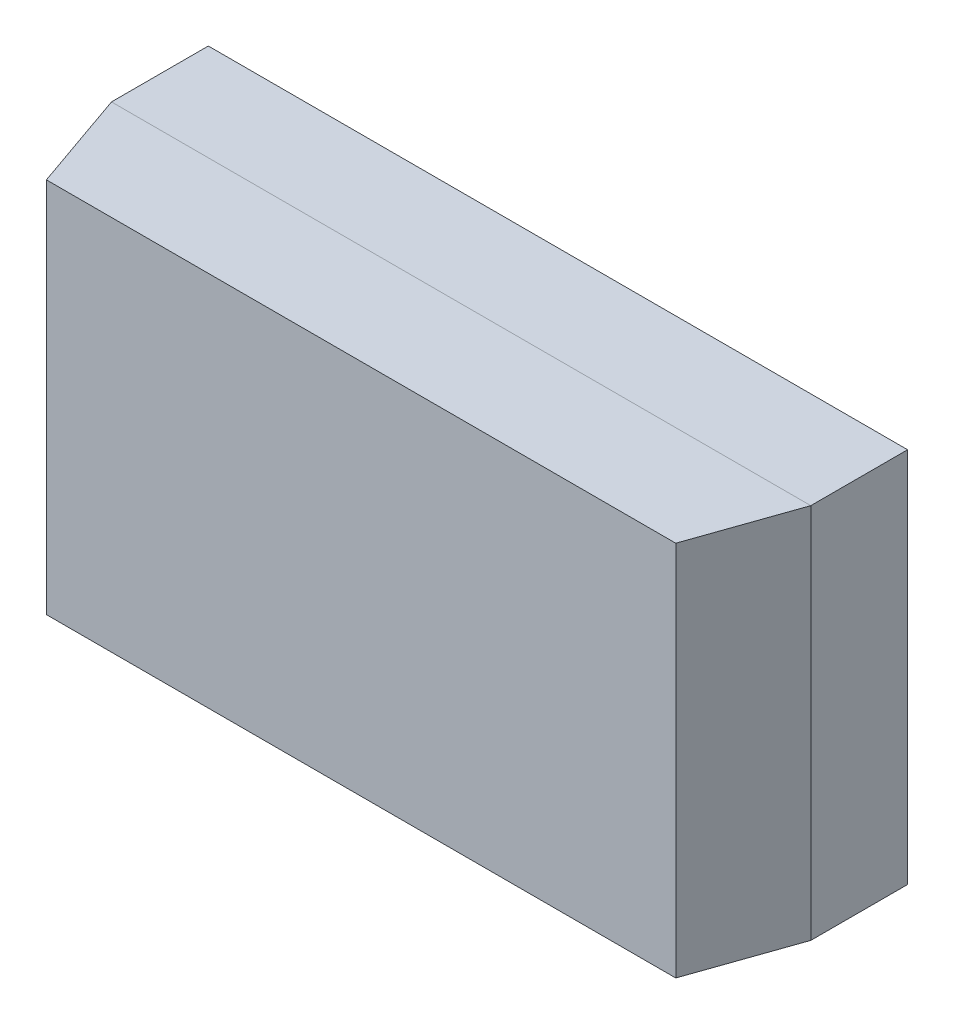
ISO-10303-21;
HEADER;
FILE_DESCRIPTION(('STEP AP214'),'2;1');
FILE_NAME('part.step','',(''),(''),'','','');
FILE_SCHEMA(('AUTOMOTIVE_DESIGN { 1 0 10303 214 1 1 1 1 }'));
ENDSEC;
DATA;
#1=APPLICATION_CONTEXT('core data for automotive mechanical design processes');
#2=APPLICATION_PROTOCOL_DEFINITION('international standard','automotive_design',2000,#1);
#3=PRODUCT_CONTEXT('',#1,'mechanical');
#4=PRODUCT('Part','Part','',(#3));
#5=PRODUCT_RELATED_PRODUCT_CATEGORY('part','',(#4));
#6=PRODUCT_DEFINITION_FORMATION('','',#4);
#7=PRODUCT_DEFINITION_CONTEXT('part definition',#1,'design');
#8=PRODUCT_DEFINITION('design','',#6,#7);
#9=PRODUCT_DEFINITION_SHAPE('','',#8);
#10=(LENGTH_UNIT() NAMED_UNIT(*) SI_UNIT(.MILLI.,.METRE.));
#11=(NAMED_UNIT(*) PLANE_ANGLE_UNIT() SI_UNIT($,.RADIAN.));
#12=(NAMED_UNIT(*) SI_UNIT($,.STERADIAN.) SOLID_ANGLE_UNIT());
#13=UNCERTAINTY_MEASURE_WITH_UNIT(LENGTH_MEASURE(1.E-05),#10,'distance_accuracy_value','');
#14=(GEOMETRIC_REPRESENTATION_CONTEXT(3) GLOBAL_UNCERTAINTY_ASSIGNED_CONTEXT((#13)) GLOBAL_UNIT_ASSIGNED_CONTEXT((#10,
#11,#12)) REPRESENTATION_CONTEXT('',''));
#15=CARTESIAN_POINT('',(0.,0.,0.));
#16=DIRECTION('',(0.,0.,1.));
#17=DIRECTION('',(1.,0.,0.));
#18=AXIS2_PLACEMENT_3D('',#15,#16,#17);
#19=CARTESIAN_POINT('',(-0.325,-0.175,0.017));
#20=DIRECTION('',(1.,0.,0.));
#21=DIRECTION('',(0.,0.,1.));
#22=AXIS2_PLACEMENT_3D('',#19,#20,#21);
#23=PLANE('',#22);
#24=DIRECTION('',(0.,-1.,0.));
#25=VECTOR('',#24,1.);
#26=CARTESIAN_POINT('',(-0.325,0.175,0.107));
#27=LINE('',#26,#25);
#28=CARTESIAN_POINT('',(-0.325,0.175,0.107));
#29=VERTEX_POINT('',#28);
#30=CARTESIAN_POINT('',(-0.325,-0.175,0.107));
#31=VERTEX_POINT('',#30);
#32=EDGE_CURVE('E10',#29,#31,#27,.T.);
#33=ORIENTED_EDGE('',*,*,#32,.F.);
#34=DIRECTION('',(0.,0.,1.));
#35=VECTOR('',#34,1.);
#36=CARTESIAN_POINT('',(-0.325,0.175,0.017));
#37=LINE('',#36,#35);
#38=CARTESIAN_POINT('',(-0.325,0.175,0.017));
#39=VERTEX_POINT('',#38);
#40=EDGE_CURVE('E24',#39,#29,#37,.T.);
#41=ORIENTED_EDGE('',*,*,#40,.F.);
#42=DIRECTION('',(0.,1.,0.));
#43=VECTOR('',#42,1.);
#44=CARTESIAN_POINT('',(-0.325,-0.175,0.017));
#45=LINE('',#44,#43);
#46=CARTESIAN_POINT('',(-0.325,-0.175,0.017));
#47=VERTEX_POINT('',#46);
#48=EDGE_CURVE('E377',#47,#39,#45,.T.);
#49=ORIENTED_EDGE('',*,*,#48,.F.);
#50=DIRECTION('',(0.,0.,1.));
#51=VECTOR('',#50,1.);
#52=CARTESIAN_POINT('',(-0.325,-0.175,0.017));
#53=LINE('',#52,#51);
#54=EDGE_CURVE('E373',#47,#31,#53,.T.);
#55=ORIENTED_EDGE('',*,*,#54,.T.);
#56=EDGE_LOOP('',(#33,#41,#49,#55));
#57=FACE_BOUND('',#56,.T.);
#58=ADVANCED_FACE('F16',(#57),#23,.F.);
#59=CARTESIAN_POINT('',(-0.325,-0.175,0.017));
#60=DIRECTION('',(0.,1.,0.));
#61=DIRECTION('',(0.,0.,1.));
#62=AXIS2_PLACEMENT_3D('',#59,#60,#61);
#63=PLANE('',#62);
#64=DIRECTION('',(0.,0.,1.));
#65=VECTOR('',#64,1.);
#66=CARTESIAN_POINT('',(0.325,-0.175,0.017));
#67=LINE('',#66,#65);
#68=CARTESIAN_POINT('',(0.325,-0.175,0.017));
#69=VERTEX_POINT('',#68);
#70=CARTESIAN_POINT('',(0.325,-0.175,0.107));
#71=VERTEX_POINT('',#70);
#72=EDGE_CURVE('E369',#69,#71,#67,.T.);
#73=ORIENTED_EDGE('',*,*,#72,.T.);
#74=DIRECTION('',(-1.,0.,0.));
#75=VECTOR('',#74,1.);
#76=CARTESIAN_POINT('',(0.325,-0.175,0.107));
#77=LINE('',#76,#75);
#78=EDGE_CURVE('E364',#71,#31,#77,.T.);
#79=ORIENTED_EDGE('',*,*,#78,.T.);
#80=ORIENTED_EDGE('',*,*,#54,.F.);
#81=DIRECTION('',(1.,0.,0.));
#82=VECTOR('',#81,1.);
#83=CARTESIAN_POINT('',(-0.325,-0.175,0.017));
#84=LINE('',#83,#82);
#85=EDGE_CURVE('E360',#47,#69,#84,.T.);
#86=ORIENTED_EDGE('',*,*,#85,.T.);
#87=EDGE_LOOP('',(#73,#79,#80,#86));
#88=FACE_BOUND('',#87,.T.);
#89=ADVANCED_FACE('F397',(#88),#63,.F.);
#90=CARTESIAN_POINT('',(-0.325,-0.175,0.017));
#91=DIRECTION('',(0.,0.,1.));
#92=DIRECTION('',(1.,0.,0.));
#93=AXIS2_PLACEMENT_3D('',#90,#91,#92);
#94=PLANE('',#93);
#95=DIRECTION('',(1.,0.,0.));
#96=VECTOR('',#95,1.);
#97=CARTESIAN_POINT('',(-0.325,0.175,0.017));
#98=LINE('',#97,#96);
#99=CARTESIAN_POINT('',(0.325,0.175,0.017));
#100=VERTEX_POINT('',#99);
#101=EDGE_CURVE('E356',#39,#100,#98,.T.);
#102=ORIENTED_EDGE('',*,*,#101,.T.);
#103=DIRECTION('',(0.,1.,0.));
#104=VECTOR('',#103,1.);
#105=CARTESIAN_POINT('',(0.325,-0.175,0.017));
#106=LINE('',#105,#104);
#107=EDGE_CURVE('E351',#69,#100,#106,.T.);
#108=ORIENTED_EDGE('',*,*,#107,.F.);
#109=ORIENTED_EDGE('',*,*,#85,.F.);
#110=ORIENTED_EDGE('',*,*,#48,.T.);
#111=EDGE_LOOP('',(#102,#108,#109,#110));
#112=FACE_BOUND('',#111,.T.);
#113=DIRECTION('',(0.,1.,0.));
#114=VECTOR('',#113,1.);
#115=CARTESIAN_POINT('',(0.105,-0.125,0.017));
#116=LINE('',#115,#114);
#117=CARTESIAN_POINT('',(0.105,-0.125,0.017));
#118=VERTEX_POINT('',#117);
#119=CARTESIAN_POINT('',(0.105,0.125,0.017));
#120=VERTEX_POINT('',#119);
#121=EDGE_CURVE('E346',#118,#120,#116,.T.);
#122=ORIENTED_EDGE('',*,*,#121,.F.);
#123=DIRECTION('',(1.,0.,0.));
#124=VECTOR('',#123,1.);
#125=CARTESIAN_POINT('',(0.105,-0.125,0.017));
#126=LINE('',#125,#124);
#127=CARTESIAN_POINT('',(0.275,-0.125,0.017));
#128=VERTEX_POINT('',#127);
#129=EDGE_CURVE('E342',#118,#128,#126,.T.);
#130=ORIENTED_EDGE('',*,*,#129,.T.);
#131=DIRECTION('',(0.,1.,0.));
#132=VECTOR('',#131,1.);
#133=CARTESIAN_POINT('',(0.275,-0.125,0.017));
#134=LINE('',#133,#132);
#135=CARTESIAN_POINT('',(0.275,0.125,0.017));
#136=VERTEX_POINT('',#135);
#137=EDGE_CURVE('E338',#128,#136,#134,.T.);
#138=ORIENTED_EDGE('',*,*,#137,.T.);
#139=DIRECTION('',(1.,0.,0.));
#140=VECTOR('',#139,1.);
#141=CARTESIAN_POINT('',(0.105,0.125,0.017));
#142=LINE('',#141,#140);
#143=EDGE_CURVE('E333',#120,#136,#142,.T.);
#144=ORIENTED_EDGE('',*,*,#143,.F.);
#145=EDGE_LOOP('',(#122,#130,#138,#144));
#146=FACE_BOUND('',#145,.T.);
#147=DIRECTION('',(0.,1.,0.));
#148=VECTOR('',#147,1.);
#149=CARTESIAN_POINT('',(-0.275,-0.125,0.017));
#150=LINE('',#149,#148);
#151=CARTESIAN_POINT('',(-0.275,-0.125,0.017));
#152=VERTEX_POINT('',#151);
#153=CARTESIAN_POINT('',(-0.275,0.125,0.017));
#154=VERTEX_POINT('',#153);
#155=EDGE_CURVE('E328',#152,#154,#150,.T.);
#156=ORIENTED_EDGE('',*,*,#155,.F.);
#157=DIRECTION('',(1.,0.,0.));
#158=VECTOR('',#157,1.);
#159=CARTESIAN_POINT('',(-0.275,-0.125,0.017));
#160=LINE('',#159,#158);
#161=CARTESIAN_POINT('',(-0.105,-0.125,0.017));
#162=VERTEX_POINT('',#161);
#163=EDGE_CURVE('E324',#152,#162,#160,.T.);
#164=ORIENTED_EDGE('',*,*,#163,.T.);
#165=DIRECTION('',(0.,1.,0.));
#166=VECTOR('',#165,1.);
#167=CARTESIAN_POINT('',(-0.105,-0.125,0.017));
#168=LINE('',#167,#166);
#169=CARTESIAN_POINT('',(-0.105,0.125,0.017));
#170=VERTEX_POINT('',#169);
#171=EDGE_CURVE('E320',#162,#170,#168,.T.);
#172=ORIENTED_EDGE('',*,*,#171,.T.);
#173=DIRECTION('',(1.,0.,0.));
#174=VECTOR('',#173,1.);
#175=CARTESIAN_POINT('',(-0.275,0.125,0.017));
#176=LINE('',#175,#174);
#177=EDGE_CURVE('E315',#154,#170,#176,.T.);
#178=ORIENTED_EDGE('',*,*,#177,.F.);
#179=EDGE_LOOP('',(#156,#164,#172,#178));
#180=FACE_BOUND('',#179,.T.);
#181=DIRECTION('',(0.866025403784329,0.50000000000019,0.));
#182=VECTOR('',#181,1.);
#183=CARTESIAN_POINT('',(-0.07274613391789,0.,0.017));
#184=LINE('',#183,#182);
#185=CARTESIAN_POINT('',(-0.07274613391789,0.,0.017));
#186=VERTEX_POINT('',#185);
#187=CARTESIAN_POINT('',(0.07274613391789,0.084,0.017));
#188=VERTEX_POINT('',#187);
#189=EDGE_CURVE('E310',#186,#188,#184,.T.);
#190=ORIENTED_EDGE('',*,*,#189,.F.);
#191=DIRECTION('',(-0.866025403784329,0.50000000000019,0.));
#192=VECTOR('',#191,1.);
#193=CARTESIAN_POINT('',(0.07274613391789,-0.084,0.017));
#194=LINE('',#193,#192);
#195=CARTESIAN_POINT('',(0.07274613391789,-0.084,0.017));
#196=VERTEX_POINT('',#195);
#197=EDGE_CURVE('E305',#196,#186,#194,.T.);
#198=ORIENTED_EDGE('',*,*,#197,.F.);
#199=DIRECTION('',(0.,-1.,0.));
#200=VECTOR('',#199,1.);
#201=CARTESIAN_POINT('',(0.07274613391789,0.084,0.017));
#202=LINE('',#201,#200);
#203=EDGE_CURVE('E300',#188,#196,#202,.T.);
#204=ORIENTED_EDGE('',*,*,#203,.F.);
#205=EDGE_LOOP('',(#190,#198,#204));
#206=FACE_BOUND('',#205,.T.);
#207=ADVANCED_FACE('F393',(#112,#146,#180,#206),#94,.F.);
#208=CARTESIAN_POINT('',(0.07274613391789,0.084,0.0085));
#209=DIRECTION('',(1.,0.,0.));
#210=DIRECTION('',(0.,-1.,0.));
#211=AXIS2_PLACEMENT_3D('',#208,#209,#210);
#212=PLANE('',#211);
#213=DIRECTION('',(0.,0.,1.));
#214=VECTOR('',#213,1.);
#215=CARTESIAN_POINT('',(0.07274613391789,0.084,0.0085));
#216=LINE('',#215,#214);
#217=CARTESIAN_POINT('',(0.07274613391789,0.084,0.0085));
#218=VERTEX_POINT('',#217);
#219=EDGE_CURVE('E295',#218,#188,#216,.T.);
#220=ORIENTED_EDGE('',*,*,#219,.T.);
#221=ORIENTED_EDGE('',*,*,#203,.T.);
#222=DIRECTION('',(0.,0.,1.));
#223=VECTOR('',#222,1.);
#224=CARTESIAN_POINT('',(0.07274613391789,-0.084,0.0085));
#225=LINE('',#224,#223);
#226=CARTESIAN_POINT('',(0.07274613391789,-0.084,0.0085));
#227=VERTEX_POINT('',#226);
#228=EDGE_CURVE('E290',#227,#196,#225,.T.);
#229=ORIENTED_EDGE('',*,*,#228,.F.);
#230=DIRECTION('',(0.,-1.,0.));
#231=VECTOR('',#230,1.);
#232=CARTESIAN_POINT('',(0.07274613391789,0.084,0.0085));
#233=LINE('',#232,#231);
#234=EDGE_CURVE('E285',#218,#227,#233,.T.);
#235=ORIENTED_EDGE('',*,*,#234,.F.);
#236=EDGE_LOOP('',(#220,#221,#229,#235));
#237=FACE_BOUND('',#236,.T.);
#238=ADVANCED_FACE('F422',(#237),#212,.T.);
#239=CARTESIAN_POINT('',(0.02424871130596,0.,0.0085));
#240=DIRECTION('',(0.,0.,-1.));
#241=DIRECTION('',(-1.,0.,0.));
#242=AXIS2_PLACEMENT_3D('',#239,#240,#241);
#243=PLANE('',#242);
#244=DIRECTION('',(0.866025403784329,0.50000000000019,0.));
#245=VECTOR('',#244,1.);
#246=CARTESIAN_POINT('',(-0.07274613391789,0.,0.0085));
#247=LINE('',#246,#245);
#248=CARTESIAN_POINT('',(-0.07274613391789,0.,0.0085));
#249=VERTEX_POINT('',#248);
#250=EDGE_CURVE('E280',#249,#218,#247,.T.);
#251=ORIENTED_EDGE('',*,*,#250,.T.);
#252=ORIENTED_EDGE('',*,*,#234,.T.);
#253=DIRECTION('',(-0.866025403784329,0.50000000000019,0.));
#254=VECTOR('',#253,1.);
#255=CARTESIAN_POINT('',(0.07274613391789,-0.084,0.0085));
#256=LINE('',#255,#254);
#257=EDGE_CURVE('E276',#227,#249,#256,.T.);
#258=ORIENTED_EDGE('',*,*,#257,.T.);
#259=EDGE_LOOP('',(#251,#252,#258));
#260=FACE_BOUND('',#259,.T.);
#261=ADVANCED_FACE('F427',(#260),#243,.T.);
#262=CARTESIAN_POINT('',(0.07274613391789,-0.084,0.0085));
#263=DIRECTION('',(-0.50000000000019,-0.866025403784329,0.));
#264=DIRECTION('',(-0.866025403784329,0.50000000000019,0.));
#265=AXIS2_PLACEMENT_3D('',#262,#263,#264);
#266=PLANE('',#265);
#267=ORIENTED_EDGE('',*,*,#228,.T.);
#268=ORIENTED_EDGE('',*,*,#197,.T.);
#269=DIRECTION('',(0.,0.,1.));
#270=VECTOR('',#269,1.);
#271=CARTESIAN_POINT('',(-0.07274613391789,0.,0.0085));
#272=LINE('',#271,#270);
#273=EDGE_CURVE('E271',#249,#186,#272,.T.);
#274=ORIENTED_EDGE('',*,*,#273,.F.);
#275=ORIENTED_EDGE('',*,*,#257,.F.);
#276=EDGE_LOOP('',(#267,#268,#274,#275));
#277=FACE_BOUND('',#276,.T.);
#278=ADVANCED_FACE('F431',(#277),#266,.T.);
#279=CARTESIAN_POINT('',(-0.07274613391789,0.,0.0085));
#280=DIRECTION('',(-0.50000000000019,0.866025403784329,0.));
#281=DIRECTION('',(0.866025403784329,0.50000000000019,0.));
#282=AXIS2_PLACEMENT_3D('',#279,#280,#281);
#283=PLANE('',#282);
#284=ORIENTED_EDGE('',*,*,#273,.T.);
#285=ORIENTED_EDGE('',*,*,#189,.T.);
#286=ORIENTED_EDGE('',*,*,#219,.F.);
#287=ORIENTED_EDGE('',*,*,#250,.F.);
#288=EDGE_LOOP('',(#284,#285,#286,#287));
#289=FACE_BOUND('',#288,.T.);
#290=ADVANCED_FACE('F435',(#289),#283,.T.);
#291=CARTESIAN_POINT('',(-0.275,0.125,0.));
#292=DIRECTION('',(0.,1.,0.));
#293=DIRECTION('',(0.,0.,1.));
#294=AXIS2_PLACEMENT_3D('',#291,#292,#293);
#295=PLANE('',#294);
#296=DIRECTION('',(1.,0.,0.));
#297=VECTOR('',#296,1.);
#298=CARTESIAN_POINT('',(-0.275,0.125,0.));
#299=LINE('',#298,#297);
#300=CARTESIAN_POINT('',(-0.275,0.125,0.));
#301=VERTEX_POINT('',#300);
#302=CARTESIAN_POINT('',(-0.105,0.125,0.));
#303=VERTEX_POINT('',#302);
#304=EDGE_CURVE('E266',#301,#303,#299,.T.);
#305=ORIENTED_EDGE('',*,*,#304,.F.);
#306=DIRECTION('',(0.,0.,1.));
#307=VECTOR('',#306,1.);
#308=CARTESIAN_POINT('',(-0.275,0.125,0.));
#309=LINE('',#308,#307);
#310=EDGE_CURVE('E261',#301,#154,#309,.T.);
#311=ORIENTED_EDGE('',*,*,#310,.T.);
#312=ORIENTED_EDGE('',*,*,#177,.T.);
#313=DIRECTION('',(0.,0.,1.));
#314=VECTOR('',#313,1.);
#315=CARTESIAN_POINT('',(-0.105,0.125,0.));
#316=LINE('',#315,#314);
#317=EDGE_CURVE('E256',#303,#170,#316,.T.);
#318=ORIENTED_EDGE('',*,*,#317,.F.);
#319=EDGE_LOOP('',(#305,#311,#312,#318));
#320=FACE_BOUND('',#319,.T.);
#321=ADVANCED_FACE('F439',(#320),#295,.T.);
#322=CARTESIAN_POINT('',(-0.105,-0.125,0.));
#323=DIRECTION('',(1.,0.,0.));
#324=DIRECTION('',(0.,0.,1.));
#325=AXIS2_PLACEMENT_3D('',#322,#323,#324);
#326=PLANE('',#325);
#327=DIRECTION('',(0.,0.,1.));
#328=VECTOR('',#327,1.);
#329=CARTESIAN_POINT('',(-0.105,-0.125,0.));
#330=LINE('',#329,#328);
#331=CARTESIAN_POINT('',(-0.105,-0.125,0.));
#332=VERTEX_POINT('',#331);
#333=EDGE_CURVE('E251',#332,#162,#330,.T.);
#334=ORIENTED_EDGE('',*,*,#333,.F.);
#335=DIRECTION('',(0.,1.,0.));
#336=VECTOR('',#335,1.);
#337=CARTESIAN_POINT('',(-0.105,-0.125,0.));
#338=LINE('',#337,#336);
#339=EDGE_CURVE('E246',#332,#303,#338,.T.);
#340=ORIENTED_EDGE('',*,*,#339,.T.);
#341=ORIENTED_EDGE('',*,*,#317,.T.);
#342=ORIENTED_EDGE('',*,*,#171,.F.);
#343=EDGE_LOOP('',(#334,#340,#341,#342));
#344=FACE_BOUND('',#343,.T.);
#345=ADVANCED_FACE('F443',(#344),#326,.T.);
#346=CARTESIAN_POINT('',(-0.275,-0.125,0.));
#347=DIRECTION('',(0.,0.,1.));
#348=DIRECTION('',(1.,0.,0.));
#349=AXIS2_PLACEMENT_3D('',#346,#347,#348);
#350=PLANE('',#349);
#351=ORIENTED_EDGE('',*,*,#304,.T.);
#352=ORIENTED_EDGE('',*,*,#339,.F.);
#353=DIRECTION('',(1.,0.,0.));
#354=VECTOR('',#353,1.);
#355=CARTESIAN_POINT('',(-0.275,-0.125,0.));
#356=LINE('',#355,#354);
#357=CARTESIAN_POINT('',(-0.275,-0.125,0.));
#358=VERTEX_POINT('',#357);
#359=EDGE_CURVE('E241',#358,#332,#356,.T.);
#360=ORIENTED_EDGE('',*,*,#359,.F.);
#361=DIRECTION('',(0.,1.,0.));
#362=VECTOR('',#361,1.);
#363=CARTESIAN_POINT('',(-0.275,-0.125,0.));
#364=LINE('',#363,#362);
#365=EDGE_CURVE('E236',#358,#301,#364,.T.);
#366=ORIENTED_EDGE('',*,*,#365,.T.);
#367=EDGE_LOOP('',(#351,#352,#360,#366));
#368=FACE_BOUND('',#367,.T.);
#369=ADVANCED_FACE('F447',(#368),#350,.F.);
#370=CARTESIAN_POINT('',(-0.275,-0.125,0.));
#371=DIRECTION('',(1.,0.,0.));
#372=DIRECTION('',(0.,0.,1.));
#373=AXIS2_PLACEMENT_3D('',#370,#371,#372);
#374=PLANE('',#373);
#375=ORIENTED_EDGE('',*,*,#155,.T.);
#376=ORIENTED_EDGE('',*,*,#310,.F.);
#377=ORIENTED_EDGE('',*,*,#365,.F.);
#378=DIRECTION('',(0.,0.,1.));
#379=VECTOR('',#378,1.);
#380=CARTESIAN_POINT('',(-0.275,-0.125,0.));
#381=LINE('',#380,#379);
#382=EDGE_CURVE('E231',#358,#152,#381,.T.);
#383=ORIENTED_EDGE('',*,*,#382,.T.);
#384=EDGE_LOOP('',(#375,#376,#377,#383));
#385=FACE_BOUND('',#384,.T.);
#386=ADVANCED_FACE('F451',(#385),#374,.F.);
#387=CARTESIAN_POINT('',(-0.275,-0.125,0.));
#388=DIRECTION('',(0.,1.,0.));
#389=DIRECTION('',(0.,0.,1.));
#390=AXIS2_PLACEMENT_3D('',#387,#388,#389);
#391=PLANE('',#390);
#392=ORIENTED_EDGE('',*,*,#333,.T.);
#393=ORIENTED_EDGE('',*,*,#163,.F.);
#394=ORIENTED_EDGE('',*,*,#382,.F.);
#395=ORIENTED_EDGE('',*,*,#359,.T.);
#396=EDGE_LOOP('',(#392,#393,#394,#395));
#397=FACE_BOUND('',#396,.T.);
#398=ADVANCED_FACE('F455',(#397),#391,.F.);
#399=CARTESIAN_POINT('',(0.105,0.125,0.));
#400=DIRECTION('',(0.,1.,0.));
#401=DIRECTION('',(0.,0.,1.));
#402=AXIS2_PLACEMENT_3D('',#399,#400,#401);
#403=PLANE('',#402);
#404=DIRECTION('',(1.,0.,0.));
#405=VECTOR('',#404,1.);
#406=CARTESIAN_POINT('',(0.105,0.125,0.));
#407=LINE('',#406,#405);
#408=CARTESIAN_POINT('',(0.105,0.125,0.));
#409=VERTEX_POINT('',#408);
#410=CARTESIAN_POINT('',(0.275,0.125,0.));
#411=VERTEX_POINT('',#410);
#412=EDGE_CURVE('E226',#409,#411,#407,.T.);
#413=ORIENTED_EDGE('',*,*,#412,.F.);
#414=DIRECTION('',(0.,0.,1.));
#415=VECTOR('',#414,1.);
#416=CARTESIAN_POINT('',(0.105,0.125,0.));
#417=LINE('',#416,#415);
#418=EDGE_CURVE('E221',#409,#120,#417,.T.);
#419=ORIENTED_EDGE('',*,*,#418,.T.);
#420=ORIENTED_EDGE('',*,*,#143,.T.);
#421=DIRECTION('',(0.,0.,1.));
#422=VECTOR('',#421,1.);
#423=CARTESIAN_POINT('',(0.275,0.125,0.));
#424=LINE('',#423,#422);
#425=EDGE_CURVE('E216',#411,#136,#424,.T.);
#426=ORIENTED_EDGE('',*,*,#425,.F.);
#427=EDGE_LOOP('',(#413,#419,#420,#426));
#428=FACE_BOUND('',#427,.T.);
#429=ADVANCED_FACE('F459',(#428),#403,.T.);
#430=CARTESIAN_POINT('',(0.275,-0.125,0.));
#431=DIRECTION('',(1.,0.,0.));
#432=DIRECTION('',(0.,0.,1.));
#433=AXIS2_PLACEMENT_3D('',#430,#431,#432);
#434=PLANE('',#433);
#435=DIRECTION('',(0.,0.,1.));
#436=VECTOR('',#435,1.);
#437=CARTESIAN_POINT('',(0.275,-0.125,0.));
#438=LINE('',#437,#436);
#439=CARTESIAN_POINT('',(0.275,-0.125,0.));
#440=VERTEX_POINT('',#439);
#441=EDGE_CURVE('E211',#440,#128,#438,.T.);
#442=ORIENTED_EDGE('',*,*,#441,.F.);
#443=DIRECTION('',(0.,1.,0.));
#444=VECTOR('',#443,1.);
#445=CARTESIAN_POINT('',(0.275,-0.125,0.));
#446=LINE('',#445,#444);
#447=EDGE_CURVE('E206',#440,#411,#446,.T.);
#448=ORIENTED_EDGE('',*,*,#447,.T.);
#449=ORIENTED_EDGE('',*,*,#425,.T.);
#450=ORIENTED_EDGE('',*,*,#137,.F.);
#451=EDGE_LOOP('',(#442,#448,#449,#450));
#452=FACE_BOUND('',#451,.T.);
#453=ADVANCED_FACE('F463',(#452),#434,.T.);
#454=CARTESIAN_POINT('',(0.105,-0.125,0.));
#455=DIRECTION('',(0.,0.,1.));
#456=DIRECTION('',(1.,0.,0.));
#457=AXIS2_PLACEMENT_3D('',#454,#455,#456);
#458=PLANE('',#457);
#459=ORIENTED_EDGE('',*,*,#412,.T.);
#460=ORIENTED_EDGE('',*,*,#447,.F.);
#461=DIRECTION('',(1.,0.,0.));
#462=VECTOR('',#461,1.);
#463=CARTESIAN_POINT('',(0.105,-0.125,0.));
#464=LINE('',#463,#462);
#465=CARTESIAN_POINT('',(0.105,-0.125,0.));
#466=VERTEX_POINT('',#465);
#467=EDGE_CURVE('E201',#466,#440,#464,.T.);
#468=ORIENTED_EDGE('',*,*,#467,.F.);
#469=DIRECTION('',(0.,1.,0.));
#470=VECTOR('',#469,1.);
#471=CARTESIAN_POINT('',(0.105,-0.125,0.));
#472=LINE('',#471,#470);
#473=EDGE_CURVE('E196',#466,#409,#472,.T.);
#474=ORIENTED_EDGE('',*,*,#473,.T.);
#475=EDGE_LOOP('',(#459,#460,#468,#474));
#476=FACE_BOUND('',#475,.T.);
#477=ADVANCED_FACE('F467',(#476),#458,.F.);
#478=CARTESIAN_POINT('',(0.105,-0.125,0.));
#479=DIRECTION('',(1.,0.,0.));
#480=DIRECTION('',(0.,0.,1.));
#481=AXIS2_PLACEMENT_3D('',#478,#479,#480);
#482=PLANE('',#481);
#483=ORIENTED_EDGE('',*,*,#121,.T.);
#484=ORIENTED_EDGE('',*,*,#418,.F.);
#485=ORIENTED_EDGE('',*,*,#473,.F.);
#486=DIRECTION('',(0.,0.,1.));
#487=VECTOR('',#486,1.);
#488=CARTESIAN_POINT('',(0.105,-0.125,0.));
#489=LINE('',#488,#487);
#490=EDGE_CURVE('E191',#466,#118,#489,.T.);
#491=ORIENTED_EDGE('',*,*,#490,.T.);
#492=EDGE_LOOP('',(#483,#484,#485,#491));
#493=FACE_BOUND('',#492,.T.);
#494=ADVANCED_FACE('F471',(#493),#482,.F.);
#495=CARTESIAN_POINT('',(0.105,-0.125,0.));
#496=DIRECTION('',(0.,1.,0.));
#497=DIRECTION('',(0.,0.,1.));
#498=AXIS2_PLACEMENT_3D('',#495,#496,#497);
#499=PLANE('',#498);
#500=ORIENTED_EDGE('',*,*,#441,.T.);
#501=ORIENTED_EDGE('',*,*,#129,.F.);
#502=ORIENTED_EDGE('',*,*,#490,.F.);
#503=ORIENTED_EDGE('',*,*,#467,.T.);
#504=EDGE_LOOP('',(#500,#501,#502,#503));
#505=FACE_BOUND('',#504,.T.);
#506=ADVANCED_FACE('F475',(#505),#499,.F.);
#507=CARTESIAN_POINT('',(0.325,-0.175,0.017));
#508=DIRECTION('',(1.,0.,0.));
#509=DIRECTION('',(0.,0.,1.));
#510=AXIS2_PLACEMENT_3D('',#507,#508,#509);
#511=PLANE('',#510);
#512=ORIENTED_EDGE('',*,*,#72,.F.);
#513=ORIENTED_EDGE('',*,*,#107,.T.);
#514=DIRECTION('',(0.,0.,1.));
#515=VECTOR('',#514,1.);
#516=CARTESIAN_POINT('',(0.325,0.175,0.017));
#517=LINE('',#516,#515);
#518=CARTESIAN_POINT('',(0.325,0.175,0.107));
#519=VERTEX_POINT('',#518);
#520=EDGE_CURVE('E187',#100,#519,#517,.T.);
#521=ORIENTED_EDGE('',*,*,#520,.T.);
#522=DIRECTION('',(0.,-1.,0.));
#523=VECTOR('',#522,1.);
#524=CARTESIAN_POINT('',(0.325,0.175,0.107));
#525=LINE('',#524,#523);
#526=EDGE_CURVE('E182',#519,#71,#525,.T.);
#527=ORIENTED_EDGE('',*,*,#526,.T.);
#528=EDGE_LOOP('',(#512,#513,#521,#527));
#529=FACE_BOUND('',#528,.T.);
#530=ADVANCED_FACE('F401',(#529),#511,.T.);
#531=CARTESIAN_POINT('',(0.2925,0.175,0.2));
#532=DIRECTION('',(0.944016499749367,0.,0.329898239160128));
#533=DIRECTION('',(0.329898239160128,0.,-0.944016499749367));
#534=AXIS2_PLACEMENT_3D('',#531,#532,#533);
#535=PLANE('',#534);
#536=DIRECTION('',(0.,-1.,0.));
#537=VECTOR('',#536,1.);
#538=CARTESIAN_POINT('',(0.2925,0.175,0.2));
#539=LINE('',#538,#537);
#540=CARTESIAN_POINT('',(0.2925,0.175,0.2));
#541=VERTEX_POINT('',#540);
#542=CARTESIAN_POINT('',(0.2925,-0.175,0.2));
#543=VERTEX_POINT('',#542);
#544=EDGE_CURVE('E178',#541,#543,#539,.T.);
#545=ORIENTED_EDGE('',*,*,#544,.T.);
#546=DIRECTION('',(0.329898239160128,0.,-0.944016499749367));
#547=VECTOR('',#546,1.);
#548=CARTESIAN_POINT('',(0.2925,-0.175,0.2));
#549=LINE('',#548,#547);
#550=EDGE_CURVE('E153',#543,#71,#549,.T.);
#551=ORIENTED_EDGE('',*,*,#550,.T.);
#552=ORIENTED_EDGE('',*,*,#526,.F.);
#553=DIRECTION('',(0.329898239160128,0.,-0.944016499749367));
#554=VECTOR('',#553,1.);
#555=CARTESIAN_POINT('',(0.2925,0.175,0.2));
#556=LINE('',#555,#554);
#557=EDGE_CURVE('E170',#541,#519,#556,.T.);
#558=ORIENTED_EDGE('',*,*,#557,.F.);
#559=EDGE_LOOP('',(#545,#551,#552,#558));
#560=FACE_BOUND('',#559,.T.);
#561=ADVANCED_FACE('F403',(#560),#535,.T.);
#562=CARTESIAN_POINT('',(0.,0.175,0.15138936053));
#563=DIRECTION('',(0.,1.,0.));
#564=DIRECTION('',(0.,0.,1.));
#565=AXIS2_PLACEMENT_3D('',#562,#563,#564);
#566=PLANE('',#565);
#567=DIRECTION('',(0.329898239160128,0.,0.944016499749367));
#568=VECTOR('',#567,1.);
#569=CARTESIAN_POINT('',(-0.325,0.175,0.107));
#570=LINE('',#569,#568);
#571=CARTESIAN_POINT('',(-0.2925,0.175,0.2));
#572=VERTEX_POINT('',#571);
#573=EDGE_CURVE('E166',#29,#572,#570,.T.);
#574=ORIENTED_EDGE('',*,*,#573,.T.);
#575=DIRECTION('',(1.,0.,0.));
#576=VECTOR('',#575,1.);
#577=CARTESIAN_POINT('',(-0.2925,0.175,0.2));
#578=LINE('',#577,#576);
#579=EDGE_CURVE('E140',#572,#541,#578,.T.);
#580=ORIENTED_EDGE('',*,*,#579,.T.);
#581=ORIENTED_EDGE('',*,*,#557,.T.);
#582=DIRECTION('',(-1.,0.,0.));
#583=VECTOR('',#582,1.);
#584=CARTESIAN_POINT('',(0.325,0.175,0.107));
#585=LINE('',#584,#583);
#586=EDGE_CURVE('E143',#519,#29,#585,.T.);
#587=ORIENTED_EDGE('',*,*,#586,.T.);
#588=EDGE_LOOP('',(#574,#580,#581,#587));
#589=FACE_BOUND('',#588,.T.);
#590=ADVANCED_FACE('F405',(#589),#566,.T.);
#591=CARTESIAN_POINT('',(-0.325,0.175,0.017));
#592=DIRECTION('',(0.,1.,0.));
#593=DIRECTION('',(0.,0.,1.));
#594=AXIS2_PLACEMENT_3D('',#591,#592,#593);
#595=PLANE('',#594);
#596=ORIENTED_EDGE('',*,*,#101,.F.);
#597=ORIENTED_EDGE('',*,*,#40,.T.);
#598=ORIENTED_EDGE('',*,*,#586,.F.);
#599=ORIENTED_EDGE('',*,*,#520,.F.);
#600=EDGE_LOOP('',(#596,#597,#598,#599));
#601=FACE_BOUND('',#600,.T.);
#602=ADVANCED_FACE('F388',(#601),#595,.T.);
#603=CARTESIAN_POINT('',(-0.2925,0.175,0.2));
#604=DIRECTION('',(0.,0.,1.));
#605=DIRECTION('',(1.,0.,0.));
#606=AXIS2_PLACEMENT_3D('',#603,#604,#605);
#607=PLANE('',#606);
#608=DIRECTION('',(0.,-1.,0.));
#609=VECTOR('',#608,1.);
#610=CARTESIAN_POINT('',(-0.2925,0.175,0.2));
#611=LINE('',#610,#609);
#612=CARTESIAN_POINT('',(-0.2925,-0.175,0.2));
#613=VERTEX_POINT('',#612);
#614=EDGE_CURVE('E132',#572,#613,#611,.T.);
#615=ORIENTED_EDGE('',*,*,#614,.T.);
#616=DIRECTION('',(1.,0.,0.));
#617=VECTOR('',#616,1.);
#618=CARTESIAN_POINT('',(-0.2925,-0.175,0.2));
#619=LINE('',#618,#617);
#620=EDGE_CURVE('E137',#613,#543,#619,.T.);
#621=ORIENTED_EDGE('',*,*,#620,.T.);
#622=ORIENTED_EDGE('',*,*,#544,.F.);
#623=ORIENTED_EDGE('',*,*,#579,.F.);
#624=EDGE_LOOP('',(#615,#621,#622,#623));
#625=FACE_BOUND('',#624,.T.);
#626=ADVANCED_FACE('F134',(#625),#607,.T.);
#627=CARTESIAN_POINT('',(0.,-0.175,0.15138936053));
#628=DIRECTION('',(0.,1.,0.));
#629=DIRECTION('',(0.,0.,1.));
#630=AXIS2_PLACEMENT_3D('',#627,#628,#629);
#631=PLANE('',#630);
#632=ORIENTED_EDGE('',*,*,#78,.F.);
#633=ORIENTED_EDGE('',*,*,#550,.F.);
#634=ORIENTED_EDGE('',*,*,#620,.F.);
#635=DIRECTION('',(0.329898239160128,0.,0.944016499749367));
#636=VECTOR('',#635,1.);
#637=CARTESIAN_POINT('',(-0.325,-0.175,0.107));
#638=LINE('',#637,#636);
#639=EDGE_CURVE('E146',#31,#613,#638,.T.);
#640=ORIENTED_EDGE('',*,*,#639,.F.);
#641=EDGE_LOOP('',(#632,#633,#634,#640));
#642=FACE_BOUND('',#641,.T.);
#643=ADVANCED_FACE('F151',(#642),#631,.F.);
#644=CARTESIAN_POINT('',(-0.325,0.175,0.107));
#645=DIRECTION('',(-0.944016499749367,0.,0.329898239160128));
#646=DIRECTION('',(0.329898239160128,0.,0.944016499749367));
#647=AXIS2_PLACEMENT_3D('',#644,#645,#646);
#648=PLANE('',#647);
#649=ORIENTED_EDGE('',*,*,#32,.T.);
#650=ORIENTED_EDGE('',*,*,#639,.T.);
#651=ORIENTED_EDGE('',*,*,#614,.F.);
#652=ORIENTED_EDGE('',*,*,#573,.F.);
#653=EDGE_LOOP('',(#649,#650,#651,#652));
#654=FACE_BOUND('',#653,.T.);
#655=ADVANCED_FACE('F147',(#654),#648,.T.);
#656=CLOSED_SHELL('',(#58,#89,#207,#238,#261,#278,#290,#321,#345,#369,#386,#398,#429,#453,#477,
#494,#506,#530,#561,#590,#602,#626,#643,#655));
#657=MANIFOLD_SOLID_BREP('B1',#656);
#658=ADVANCED_BREP_SHAPE_REPRESENTATION('',(#18,#657),#14);
#659=SHAPE_DEFINITION_REPRESENTATION(#9,#658);
ENDSEC;
END-ISO-10303-21;
